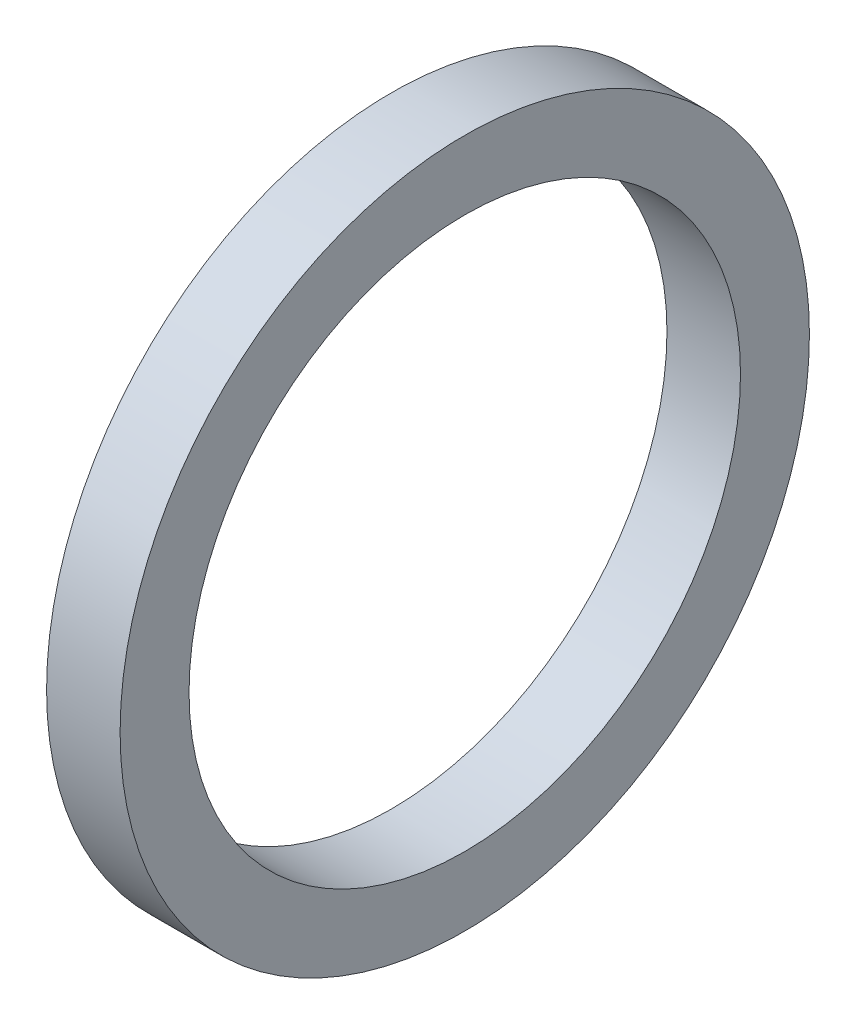
ISO-10303-21;
HEADER;
FILE_DESCRIPTION(('STEP AP214'),'2;1');
FILE_NAME('part.step','',(''),(''),'','','');
FILE_SCHEMA(('AUTOMOTIVE_DESIGN { 1 0 10303 214 1 1 1 1 }'));
ENDSEC;
DATA;
#1=APPLICATION_CONTEXT('core data for automotive mechanical design processes');
#2=APPLICATION_PROTOCOL_DEFINITION('international standard','automotive_design',2000,#1);
#3=PRODUCT_CONTEXT('',#1,'mechanical');
#4=PRODUCT('Part','Part','',(#3));
#5=PRODUCT_RELATED_PRODUCT_CATEGORY('part','',(#4));
#6=PRODUCT_DEFINITION_FORMATION('','',#4);
#7=PRODUCT_DEFINITION_CONTEXT('part definition',#1,'design');
#8=PRODUCT_DEFINITION('design','',#6,#7);
#9=PRODUCT_DEFINITION_SHAPE('','',#8);
#10=(LENGTH_UNIT() NAMED_UNIT(*) SI_UNIT(.MILLI.,.METRE.));
#11=(NAMED_UNIT(*) PLANE_ANGLE_UNIT() SI_UNIT($,.RADIAN.));
#12=(NAMED_UNIT(*) SI_UNIT($,.STERADIAN.) SOLID_ANGLE_UNIT());
#13=UNCERTAINTY_MEASURE_WITH_UNIT(LENGTH_MEASURE(1.E-05),#10,'distance_accuracy_value','');
#14=(GEOMETRIC_REPRESENTATION_CONTEXT(3) GLOBAL_UNCERTAINTY_ASSIGNED_CONTEXT((#13)) GLOBAL_UNIT_ASSIGNED_CONTEXT((#10,
#11,#12)) REPRESENTATION_CONTEXT('',''));
#15=CARTESIAN_POINT('',(0.,0.,0.));
#16=DIRECTION('',(0.,0.,1.));
#17=DIRECTION('',(1.,0.,0.));
#18=AXIS2_PLACEMENT_3D('',#15,#16,#17);
#19=CARTESIAN_POINT('',(0.,-7.62,0.));
#20=DIRECTION('',(-1.,0.,0.));
#21=DIRECTION('',(0.,0.,1.));
#22=AXIS2_PLACEMENT_3D('',#19,#20,#21);
#23=PLANE('',#22);
#24=CARTESIAN_POINT('',(0.,0.,0.));
#25=DIRECTION('',(-1.,0.,0.));
#26=DIRECTION('',(0.,0.,1.));
#27=AXIS2_PLACEMENT_3D('',#24,#25,#26);
#28=CIRCLE('',#27,9.525);
#29=CARTESIAN_POINT('',(0.,0.,9.525));
#30=VERTEX_POINT('',#29);
#31=EDGE_CURVE('E10',#30,#30,#28,.T.);
#32=ORIENTED_EDGE('',*,*,#31,.T.);
#33=EDGE_LOOP('',(#32));
#34=FACE_BOUND('',#33,.T.);
#35=CARTESIAN_POINT('',(0.,0.,0.));
#36=DIRECTION('',(-1.,0.,0.));
#37=DIRECTION('',(0.,0.,1.));
#38=AXIS2_PLACEMENT_3D('',#35,#36,#37);
#39=CIRCLE('',#38,7.62);
#40=CARTESIAN_POINT('',(0.,0.,7.62));
#41=VERTEX_POINT('',#40);
#42=EDGE_CURVE('E43',#41,#41,#39,.T.);
#43=ORIENTED_EDGE('',*,*,#42,.F.);
#44=EDGE_LOOP('',(#43));
#45=FACE_BOUND('',#44,.T.);
#46=ADVANCED_FACE('F29',(#34,#45),#23,.T.);
#47=CARTESIAN_POINT('',(-43.7165807560137,0.,0.));
#48=DIRECTION('',(-1.,0.,0.));
#49=DIRECTION('',(0.,0.,1.));
#50=AXIS2_PLACEMENT_3D('',#47,#48,#49);
#51=CYLINDRICAL_SURFACE('',#50,9.525);
#52=CARTESIAN_POINT('',(2.032,0.,0.));
#53=DIRECTION('',(-1.,0.,0.));
#54=DIRECTION('',(0.,0.,1.));
#55=AXIS2_PLACEMENT_3D('',#52,#53,#54);
#56=CIRCLE('',#55,9.525);
#57=CARTESIAN_POINT('',(2.032,0.,9.525));
#58=VERTEX_POINT('',#57);
#59=EDGE_CURVE('E35',#58,#58,#56,.T.);
#60=ORIENTED_EDGE('',*,*,#59,.T.);
#61=EDGE_LOOP('',(#60));
#62=FACE_BOUND('',#61,.T.);
#63=ORIENTED_EDGE('',*,*,#31,.F.);
#64=EDGE_LOOP('',(#63));
#65=FACE_BOUND('',#64,.T.);
#66=ADVANCED_FACE('F53',(#62,#65),#51,.T.);
#67=CARTESIAN_POINT('',(2.032,-7.62,0.));
#68=DIRECTION('',(1.,0.,0.));
#69=DIRECTION('',(0.,0.,-1.));
#70=AXIS2_PLACEMENT_3D('',#67,#68,#69);
#71=PLANE('',#70);
#72=CARTESIAN_POINT('',(2.032,0.,0.));
#73=DIRECTION('',(-1.,0.,0.));
#74=DIRECTION('',(0.,0.,1.));
#75=AXIS2_PLACEMENT_3D('',#72,#73,#74);
#76=CIRCLE('',#75,7.62);
#77=CARTESIAN_POINT('',(2.032,0.,7.62));
#78=VERTEX_POINT('',#77);
#79=EDGE_CURVE('E39',#78,#78,#76,.T.);
#80=ORIENTED_EDGE('',*,*,#79,.T.);
#81=EDGE_LOOP('',(#80));
#82=FACE_BOUND('',#81,.T.);
#83=ORIENTED_EDGE('',*,*,#59,.F.);
#84=EDGE_LOOP('',(#83));
#85=FACE_BOUND('',#84,.T.);
#86=ADVANCED_FACE('F57',(#82,#85),#71,.T.);
#87=CARTESIAN_POINT('',(-43.7165807560137,0.,0.));
#88=DIRECTION('',(-1.,0.,0.));
#89=DIRECTION('',(0.,0.,1.));
#90=AXIS2_PLACEMENT_3D('',#87,#88,#89);
#91=CYLINDRICAL_SURFACE('',#90,7.62);
#92=ORIENTED_EDGE('',*,*,#42,.T.);
#93=EDGE_LOOP('',(#92));
#94=FACE_BOUND('',#93,.T.);
#95=ORIENTED_EDGE('',*,*,#79,.F.);
#96=EDGE_LOOP('',(#95));
#97=FACE_BOUND('',#96,.T.);
#98=ADVANCED_FACE('F49',(#94,#97),#91,.F.);
#99=CLOSED_SHELL('',(#46,#66,#86,#98));
#100=MANIFOLD_SOLID_BREP('B2',#99);
#101=ADVANCED_BREP_SHAPE_REPRESENTATION('',(#18,#100),#14);
#102=SHAPE_DEFINITION_REPRESENTATION(#9,#101);
ENDSEC;
END-ISO-10303-21;
